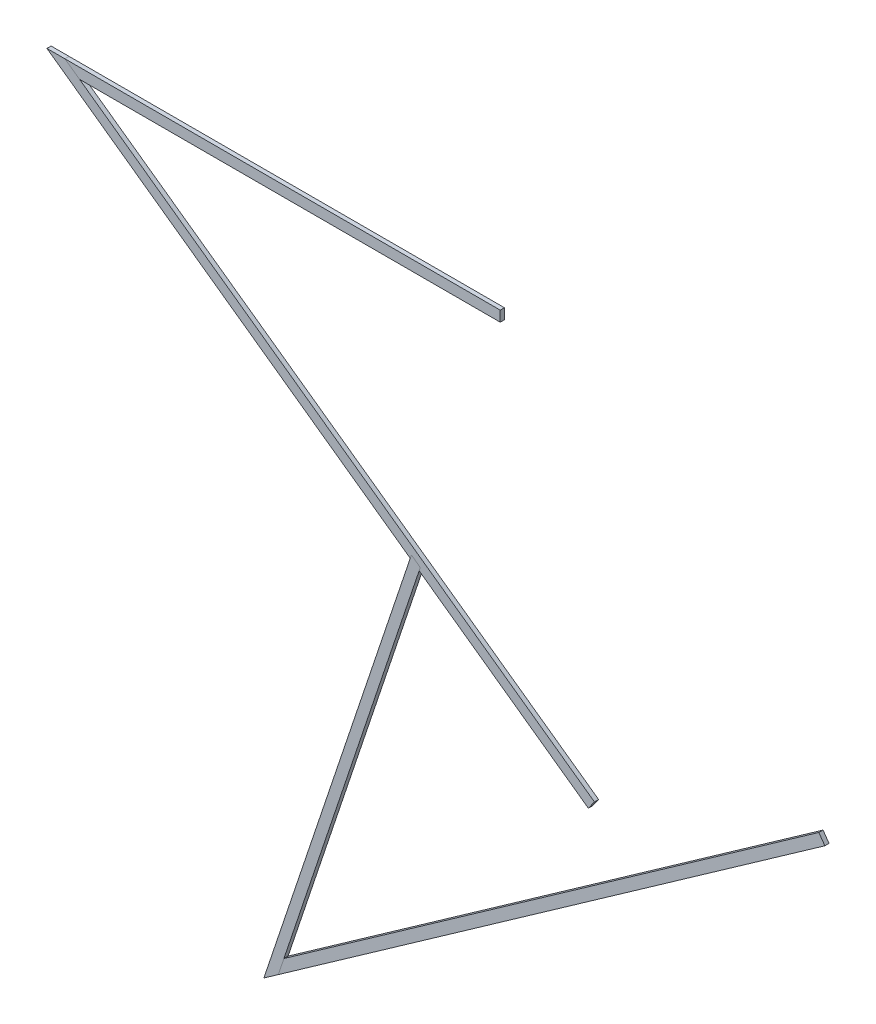
ISO-10303-21;
HEADER;
FILE_DESCRIPTION(('STEP AP214'),'2;1');
FILE_NAME('part.step','',(''),(''),'','','');
FILE_SCHEMA(('AUTOMOTIVE_DESIGN { 1 0 10303 214 1 1 1 1 }'));
ENDSEC;
DATA;
#1=APPLICATION_CONTEXT('core data for automotive mechanical design processes');
#2=APPLICATION_PROTOCOL_DEFINITION('international standard','automotive_design',2000,#1);
#3=PRODUCT_CONTEXT('',#1,'mechanical');
#4=PRODUCT('Part','Part','',(#3));
#5=PRODUCT_RELATED_PRODUCT_CATEGORY('part','',(#4));
#6=PRODUCT_DEFINITION_FORMATION('','',#4);
#7=PRODUCT_DEFINITION_CONTEXT('part definition',#1,'design');
#8=PRODUCT_DEFINITION('design','',#6,#7);
#9=PRODUCT_DEFINITION_SHAPE('','',#8);
#10=(LENGTH_UNIT() NAMED_UNIT(*) SI_UNIT(.MILLI.,.METRE.));
#11=(NAMED_UNIT(*) PLANE_ANGLE_UNIT() SI_UNIT($,.RADIAN.));
#12=(NAMED_UNIT(*) SI_UNIT($,.STERADIAN.) SOLID_ANGLE_UNIT());
#13=UNCERTAINTY_MEASURE_WITH_UNIT(LENGTH_MEASURE(1.E-05),#10,'distance_accuracy_value','');
#14=(GEOMETRIC_REPRESENTATION_CONTEXT(3) GLOBAL_UNCERTAINTY_ASSIGNED_CONTEXT((#13)) GLOBAL_UNIT_ASSIGNED_CONTEXT((#10,
#11,#12)) REPRESENTATION_CONTEXT('',''));
#15=CARTESIAN_POINT('',(0.,0.,0.));
#16=DIRECTION('',(0.,0.,1.));
#17=DIRECTION('',(1.,0.,0.));
#18=AXIS2_PLACEMENT_3D('',#15,#16,#17);
#19=CARTESIAN_POINT('',(-1036.87319744402,-730.003201056248,0.));
#20=DIRECTION('',(-0.817675868795569,-0.575678880617842,0.));
#21=DIRECTION('',(0.575678880617842,-0.817675868795569,0.));
#22=AXIS2_PLACEMENT_3D('',#19,#20,#21);
#23=PLANE('',#22);
#24=DIRECTION('',(-0.575678880617842,0.817675868795569,0.));
#25=VECTOR('',#24,1.);
#26=CARTESIAN_POINT('',(2074.62418961617,-5149.4745676088,2.00000000000001));
#27=LINE('',#26,#25);
#28=CARTESIAN_POINT('',(2080.38097842235,-5157.65132629675,2.));
#29=VERTEX_POINT('',#28);
#30=CARTESIAN_POINT('',(2074.62418961617,-5149.4745676088,2.00000000000001));
#31=VERTEX_POINT('',#30);
#32=EDGE_CURVE('E112',#29,#31,#27,.T.);
#33=ORIENTED_EDGE('',*,*,#32,.F.);
#34=DIRECTION('',(0.,0.,1.));
#35=VECTOR('',#34,1.);
#36=CARTESIAN_POINT('',(2080.38097842235,-5157.65132629675,-2.));
#37=LINE('',#36,#35);
#38=CARTESIAN_POINT('',(2080.38097842235,-5157.65132629675,-2.));
#39=VERTEX_POINT('',#38);
#40=EDGE_CURVE('E130',#39,#29,#37,.T.);
#41=ORIENTED_EDGE('',*,*,#40,.F.);
#42=DIRECTION('',(0.575678880617842,-0.817675868795569,0.));
#43=VECTOR('',#42,1.);
#44=CARTESIAN_POINT('',(2080.38097842235,-5157.65132629675,-2.));
#45=LINE('',#44,#43);
#46=CARTESIAN_POINT('',(2074.62418961617,-5149.4745676088,-1.99999999999999));
#47=VERTEX_POINT('',#46);
#48=EDGE_CURVE('E132',#47,#39,#45,.T.);
#49=ORIENTED_EDGE('',*,*,#48,.F.);
#50=DIRECTION('',(0.,0.,-1.));
#51=VECTOR('',#50,1.);
#52=CARTESIAN_POINT('',(2074.62418961617,-5149.4745676088,2.00000000000001));
#53=LINE('',#52,#51);
#54=EDGE_CURVE('E124',#31,#47,#53,.T.);
#55=ORIENTED_EDGE('',*,*,#54,.F.);
#56=EDGE_LOOP('',(#33,#41,#49,#55));
#57=FACE_BOUND('',#56,.T.);
#58=ADVANCED_FACE('F66',(#57),#23,.F.);
#59=CARTESIAN_POINT('',(1556.1754390635,-5526.71450845509,-2.));
#60=DIRECTION('',(-0.575678880617844,0.817675868795567,0.));
#61=DIRECTION('',(-0.817675868795567,-0.575678880617844,0.));
#62=AXIS2_PLACEMENT_3D('',#59,#60,#61);
#63=PLANE('',#62);
#64=DIRECTION('',(0.,0.,1.));
#65=VECTOR('',#64,1.);
#66=CARTESIAN_POINT('',(1557.5164646114,-5525.77036895464,-2.));
#67=LINE('',#66,#65);
#68=CARTESIAN_POINT('',(1557.5164646114,-5525.77036895464,-2.));
#69=VERTEX_POINT('',#68);
#70=CARTESIAN_POINT('',(1557.5164646114,-5525.77036895464,2.00000000000001));
#71=VERTEX_POINT('',#70);
#72=EDGE_CURVE('E13',#69,#71,#67,.T.);
#73=ORIENTED_EDGE('',*,*,#72,.F.);
#74=DIRECTION('',(0.817675868795567,0.575678880617844,0.));
#75=VECTOR('',#74,1.);
#76=CARTESIAN_POINT('',(1556.1754390635,-5526.71450845509,-2.));
#77=LINE('',#76,#75);
#78=EDGE_CURVE('E120',#69,#39,#77,.T.);
#79=ORIENTED_EDGE('',*,*,#78,.T.);
#80=ORIENTED_EDGE('',*,*,#40,.T.);
#81=DIRECTION('',(0.817675868795567,0.575678880617844,0.));
#82=VECTOR('',#81,1.);
#83=CARTESIAN_POINT('',(1556.1754390635,-5526.71450845509,2.));
#84=LINE('',#83,#82);
#85=EDGE_CURVE('E88',#71,#29,#84,.T.);
#86=ORIENTED_EDGE('',*,*,#85,.F.);
#87=EDGE_LOOP('',(#73,#79,#80,#86));
#88=FACE_BOUND('',#87,.T.);
#89=ADVANCED_FACE('F137',(#88),#63,.F.);
#90=CARTESIAN_POINT('',(1556.1754390635,-5526.71450845509,-2.));
#91=DIRECTION('',(0.,0.,1.));
#92=DIRECTION('',(0.,-1.,0.));
#93=AXIS2_PLACEMENT_3D('',#90,#91,#92);
#94=PLANE('',#93);
#95=DIRECTION('',(-0.317848997473055,-0.948141347482206,0.));
#96=VECTOR('',#95,1.);
#97=CARTESIAN_POINT('',(1694.22816504625,-5117.96031796375,-1.99999999999999));
#98=LINE('',#97,#96);
#99=CARTESIAN_POINT('',(1562.88287637629,-5509.76240000598,-1.99999999999999));
#100=VERTEX_POINT('',#99);
#101=EDGE_CURVE('E80',#100,#69,#98,.T.);
#102=ORIENTED_EDGE('',*,*,#101,.F.);
#103=DIRECTION('',(0.817675868795567,0.575678880617844,0.));
#104=VECTOR('',#103,1.);
#105=CARTESIAN_POINT('',(1550.41865025733,-5518.53774976713,-1.99999999999999));
#106=LINE('',#105,#104);
#107=EDGE_CURVE('E118',#100,#47,#106,.T.);
#108=ORIENTED_EDGE('',*,*,#107,.T.);
#109=ORIENTED_EDGE('',*,*,#48,.T.);
#110=ORIENTED_EDGE('',*,*,#78,.F.);
#111=EDGE_LOOP('',(#102,#108,#109,#110));
#112=FACE_BOUND('',#111,.T.);
#113=ADVANCED_FACE('F116',(#112),#94,.F.);
#114=CARTESIAN_POINT('',(1550.41865025733,-5518.53774976713,2.00000000000001));
#115=DIRECTION('',(0.575678880617844,-0.817675868795567,0.));
#116=DIRECTION('',(0.817675868795567,0.575678880617844,0.));
#117=AXIS2_PLACEMENT_3D('',#114,#115,#116);
#118=PLANE('',#117);
#119=DIRECTION('',(0.,0.,-1.));
#120=VECTOR('',#119,1.);
#121=CARTESIAN_POINT('',(1562.88287637629,-5509.76240000598,2.00000000000001));
#122=LINE('',#121,#120);
#123=CARTESIAN_POINT('',(1562.88287637629,-5509.76240000598,2.00000000000001));
#124=VERTEX_POINT('',#123);
#125=EDGE_CURVE('E106',#124,#100,#122,.T.);
#126=ORIENTED_EDGE('',*,*,#125,.F.);
#127=DIRECTION('',(0.817675868795567,0.575678880617844,0.));
#128=VECTOR('',#127,1.);
#129=CARTESIAN_POINT('',(1550.41865025733,-5518.53774976713,2.00000000000001));
#130=LINE('',#129,#128);
#131=EDGE_CURVE('E74',#124,#31,#130,.T.);
#132=ORIENTED_EDGE('',*,*,#131,.T.);
#133=ORIENTED_EDGE('',*,*,#54,.T.);
#134=ORIENTED_EDGE('',*,*,#107,.F.);
#135=EDGE_LOOP('',(#126,#132,#133,#134));
#136=FACE_BOUND('',#135,.T.);
#137=ADVANCED_FACE('F122',(#136),#118,.F.);
#138=CARTESIAN_POINT('',(1550.41865025733,-5518.53774976713,2.00000000000001));
#139=DIRECTION('',(0.,0.,-1.));
#140=DIRECTION('',(0.,1.,0.));
#141=AXIS2_PLACEMENT_3D('',#138,#139,#140);
#142=PLANE('',#141);
#143=DIRECTION('',(-0.317848997473055,-0.948141347482206,0.));
#144=VECTOR('',#143,1.);
#145=CARTESIAN_POINT('',(1694.22816504625,-5117.96031796375,2.00000000000001));
#146=LINE('',#145,#144);
#147=EDGE_CURVE('E108',#124,#71,#146,.T.);
#148=ORIENTED_EDGE('',*,*,#147,.T.);
#149=ORIENTED_EDGE('',*,*,#85,.T.);
#150=ORIENTED_EDGE('',*,*,#32,.T.);
#151=ORIENTED_EDGE('',*,*,#131,.F.);
#152=EDGE_LOOP('',(#148,#149,#150,#151));
#153=FACE_BOUND('',#152,.T.);
#154=ADVANCED_FACE('F68',(#153),#142,.F.);
#155=CARTESIAN_POINT('',(1694.22816504625,-5117.96031796375,2.00000000000001));
#156=DIRECTION('',(-0.948141347482206,0.317848997473055,0.));
#157=DIRECTION('',(-0.317848997473055,-0.948141347482206,0.));
#158=AXIS2_PLACEMENT_3D('',#155,#156,#157);
#159=PLANE('',#158);
#160=ORIENTED_EDGE('',*,*,#125,.T.);
#161=ORIENTED_EDGE('',*,*,#101,.T.);
#162=ORIENTED_EDGE('',*,*,#72,.T.);
#163=ORIENTED_EDGE('',*,*,#147,.F.);
#164=EDGE_LOOP('',(#160,#161,#162,#163));
#165=FACE_BOUND('',#164,.T.);
#166=ADVANCED_FACE('F107',(#165),#159,.T.);
#167=CLOSED_SHELL('',(#58,#89,#113,#137,#154,#166));
#168=MANIFOLD_SOLID_BREP('B2',#167);
#169=CARTESIAN_POINT('',(1694.22816504625,-5117.96031796375,2.00000000000001));
#170=DIRECTION('',(0.,0.,-1.));
#171=DIRECTION('',(-1.,0.,0.));
#172=AXIS2_PLACEMENT_3D('',#169,#170,#171);
#173=PLANE('',#172);
#174=DIRECTION('',(-0.817675868795568,-0.575678880617843,0.));
#175=VECTOR('',#174,1.);
#176=CARTESIAN_POINT('',(1840.88489233756,-5326.26684255595,2.00000000000015));
#177=LINE('',#176,#175);
#178=CARTESIAN_POINT('',(1557.5164646114,-5525.77036895465,2.00000000000001));
#179=VERTEX_POINT('',#178);
#180=CARTESIAN_POINT('',(1543.71121294453,-5535.48985821624,2.));
#181=VERTEX_POINT('',#180);
#182=EDGE_CURVE('E289',#179,#181,#177,.T.);
#183=ORIENTED_EDGE('',*,*,#182,.F.);
#184=DIRECTION('',(-0.317848997473055,-0.948141347482206,0.));
#185=VECTOR('',#184,1.);
#186=CARTESIAN_POINT('',(1694.22816504625,-5117.96031796375,2.00000000000001));
#187=LINE('',#186,#185);
#188=CARTESIAN_POINT('',(1694.22816504625,-5117.96031796375,2.00000000000001));
#189=VERTEX_POINT('',#188);
#190=EDGE_CURVE('E290',#189,#179,#187,.T.);
#191=ORIENTED_EDGE('',*,*,#190,.F.);
#192=DIRECTION('',(0.948141347482205,-0.317848997473057,0.));
#193=VECTOR('',#192,1.);
#194=CARTESIAN_POINT('',(1694.22816504625,-5117.96031796375,2.00000000000001));
#195=LINE('',#194,#193);
#196=CARTESIAN_POINT('',(1684.74675157143,-5114.78182798902,2.));
#197=VERTEX_POINT('',#196);
#198=EDGE_CURVE('E305',#197,#189,#195,.T.);
#199=ORIENTED_EDGE('',*,*,#198,.F.);
#200=DIRECTION('',(-0.317848997473055,-0.948141347482206,0.));
#201=VECTOR('',#200,1.);
#202=CARTESIAN_POINT('',(1684.74675157143,-5114.78182798902,2.));
#203=LINE('',#202,#201);
#204=EDGE_CURVE('E244',#197,#181,#203,.T.);
#205=ORIENTED_EDGE('',*,*,#204,.T.);
#206=EDGE_LOOP('',(#183,#191,#199,#205));
#207=FACE_BOUND('',#206,.T.);
#208=ADVANCED_FACE('F240',(#207),#173,.F.);
#209=CARTESIAN_POINT('',(1694.22816504625,-5117.96031796375,2.00000000000001));
#210=DIRECTION('',(-0.948141347482206,0.317848997473055,0.));
#211=DIRECTION('',(-0.317848997473055,-0.948141347482206,0.));
#212=AXIS2_PLACEMENT_3D('',#209,#210,#211);
#213=PLANE('',#212);
#214=DIRECTION('',(0.,0.,1.));
#215=VECTOR('',#214,1.);
#216=CARTESIAN_POINT('',(1557.5164646114,-5525.77036895465,2.00000000000001));
#217=LINE('',#216,#215);
#218=CARTESIAN_POINT('',(1557.5164646114,-5525.77036895465,-1.99999999999999));
#219=VERTEX_POINT('',#218);
#220=EDGE_CURVE('E278',#219,#179,#217,.T.);
#221=ORIENTED_EDGE('',*,*,#220,.F.);
#222=DIRECTION('',(-0.317848997473055,-0.948141347482206,0.));
#223=VECTOR('',#222,1.);
#224=CARTESIAN_POINT('',(1694.22816504625,-5117.96031796375,-1.99999999999999));
#225=LINE('',#224,#223);
#226=CARTESIAN_POINT('',(1694.22816504625,-5117.96031796375,-1.99999999999999));
#227=VERTEX_POINT('',#226);
#228=EDGE_CURVE('E295',#227,#219,#225,.T.);
#229=ORIENTED_EDGE('',*,*,#228,.F.);
#230=DIRECTION('',(0.,0.,-1.));
#231=VECTOR('',#230,1.);
#232=CARTESIAN_POINT('',(1694.22816504625,-5117.96031796375,2.00000000000001));
#233=LINE('',#232,#231);
#234=EDGE_CURVE('E273',#189,#227,#233,.T.);
#235=ORIENTED_EDGE('',*,*,#234,.F.);
#236=ORIENTED_EDGE('',*,*,#190,.T.);
#237=EDGE_LOOP('',(#221,#229,#235,#236));
#238=FACE_BOUND('',#237,.T.);
#239=ADVANCED_FACE('F294',(#238),#213,.F.);
#240=CARTESIAN_POINT('',(1684.74675157143,-5114.78182798902,-2.));
#241=DIRECTION('',(0.,0.,1.));
#242=DIRECTION('',(1.,0.,0.));
#243=AXIS2_PLACEMENT_3D('',#240,#241,#242);
#244=PLANE('',#243);
#245=DIRECTION('',(0.817675868795568,0.575678880617843,0.));
#246=VECTOR('',#245,1.);
#247=CARTESIAN_POINT('',(1836.04185258323,-5329.67655025426,-1.99999999999985));
#248=LINE('',#247,#246);
#249=CARTESIAN_POINT('',(1543.71121294453,-5535.48985821624,-2.));
#250=VERTEX_POINT('',#249);
#251=EDGE_CURVE('E64',#250,#219,#248,.T.);
#252=ORIENTED_EDGE('',*,*,#251,.F.);
#253=DIRECTION('',(-0.317848997473055,-0.948141347482206,0.));
#254=VECTOR('',#253,1.);
#255=CARTESIAN_POINT('',(1684.74675157143,-5114.78182798902,-2.));
#256=LINE('',#255,#254);
#257=CARTESIAN_POINT('',(1684.74675157143,-5114.78182798902,-2.));
#258=VERTEX_POINT('',#257);
#259=EDGE_CURVE('E304',#258,#250,#256,.T.);
#260=ORIENTED_EDGE('',*,*,#259,.F.);
#261=DIRECTION('',(-0.948141347482205,0.317848997473057,0.));
#262=VECTOR('',#261,1.);
#263=CARTESIAN_POINT('',(1684.74675157143,-5114.78182798902,-2.));
#264=LINE('',#263,#262);
#265=EDGE_CURVE('E299',#227,#258,#264,.T.);
#266=ORIENTED_EDGE('',*,*,#265,.F.);
#267=ORIENTED_EDGE('',*,*,#228,.T.);
#268=EDGE_LOOP('',(#252,#260,#266,#267));
#269=FACE_BOUND('',#268,.T.);
#270=ADVANCED_FACE('F313',(#269),#244,.F.);
#271=CARTESIAN_POINT('',(1684.74675157143,-5114.78182798902,-2.));
#272=DIRECTION('',(0.948141347482206,-0.317848997473055,0.));
#273=DIRECTION('',(0.317848997473055,0.948141347482206,0.));
#274=AXIS2_PLACEMENT_3D('',#271,#272,#273);
#275=PLANE('',#274);
#276=DIRECTION('',(0.,0.,-1.));
#277=VECTOR('',#276,1.);
#278=CARTESIAN_POINT('',(1543.71121294453,-5535.48985821624,-2.));
#279=LINE('',#278,#277);
#280=EDGE_CURVE('E250',#181,#250,#279,.T.);
#281=ORIENTED_EDGE('',*,*,#280,.F.);
#282=ORIENTED_EDGE('',*,*,#204,.F.);
#283=DIRECTION('',(0.,0.,1.));
#284=VECTOR('',#283,1.);
#285=CARTESIAN_POINT('',(1684.74675157143,-5114.78182798902,-2.));
#286=LINE('',#285,#284);
#287=EDGE_CURVE('E259',#258,#197,#286,.T.);
#288=ORIENTED_EDGE('',*,*,#287,.F.);
#289=ORIENTED_EDGE('',*,*,#259,.T.);
#290=EDGE_LOOP('',(#281,#282,#288,#289));
#291=FACE_BOUND('',#290,.T.);
#292=ADVANCED_FACE('F314',(#291),#275,.F.);
#293=CARTESIAN_POINT('',(6818.85480079915,-6835.90821984908,0.));
#294=DIRECTION('',(0.317848997473057,0.948141347482206,0.));
#295=DIRECTION('',(-0.948141347482206,0.317848997473057,0.));
#296=AXIS2_PLACEMENT_3D('',#293,#294,#295);
#297=PLANE('',#296);
#298=ORIENTED_EDGE('',*,*,#198,.T.);
#299=ORIENTED_EDGE('',*,*,#234,.T.);
#300=ORIENTED_EDGE('',*,*,#265,.T.);
#301=ORIENTED_EDGE('',*,*,#287,.T.);
#302=EDGE_LOOP('',(#298,#299,#300,#301));
#303=FACE_BOUND('',#302,.T.);
#304=ADVANCED_FACE('F311',(#303),#297,.T.);
#305=CARTESIAN_POINT('',(1556.17543906351,-5526.71450845509,2.00000000000001));
#306=DIRECTION('',(0.575678880617843,-0.817675868795569,0.));
#307=DIRECTION('',(0.817675868795568,0.575678880617843,0.));
#308=AXIS2_PLACEMENT_3D('',#305,#306,#307);
#309=PLANE('',#308);
#310=ORIENTED_EDGE('',*,*,#220,.T.);
#311=ORIENTED_EDGE('',*,*,#182,.T.);
#312=ORIENTED_EDGE('',*,*,#280,.T.);
#313=ORIENTED_EDGE('',*,*,#251,.T.);
#314=EDGE_LOOP('',(#310,#311,#312,#313));
#315=FACE_BOUND('',#314,.T.);
#316=ADVANCED_FACE('F242',(#315),#309,.T.);
#317=CLOSED_SHELL('',(#208,#239,#270,#292,#304,#316));
#318=MANIFOLD_SOLID_BREP('B7',#317);
#319=CARTESIAN_POINT('',(1351.7834315983,-4869.1425505764,2.00000000000001));
#320=DIRECTION('',(0.,0.,-1.));
#321=DIRECTION('',(0.,1.,0.));
#322=AXIS2_PLACEMENT_3D('',#319,#320,#321);
#323=PLANE('',#322);
#324=DIRECTION('',(-0.813325166488411,0.581809396242961,0.));
#325=VECTOR('',#324,1.);
#326=CARTESIAN_POINT('',(1859.94982531455,-5231.51005215505,2.));
#327=LINE('',#326,#325);
#328=CARTESIAN_POINT('',(1367.36693006188,-4879.1425505764,2.));
#329=VERTEX_POINT('',#328);
#330=CARTESIAN_POINT('',(1353.38769267347,-4869.1425505764,2.));
#331=VERTEX_POINT('',#330);
#332=EDGE_CURVE('E238',#329,#331,#327,.T.);
#333=ORIENTED_EDGE('',*,*,#332,.F.);
#334=DIRECTION('',(1.,0.,0.));
#335=VECTOR('',#334,1.);
#336=CARTESIAN_POINT('',(1351.7834315983,-4879.1425505764,2.));
#337=LINE('',#336,#335);
#338=CARTESIAN_POINT('',(1769.83761149153,-4879.1425505764,2.));
#339=VERTEX_POINT('',#338);
#340=EDGE_CURVE('E416',#329,#339,#337,.T.);
#341=ORIENTED_EDGE('',*,*,#340,.T.);
#342=DIRECTION('',(0.,1.,0.));
#343=VECTOR('',#342,1.);
#344=CARTESIAN_POINT('',(1769.83761149153,-4869.1425505764,2.00000000000001));
#345=LINE('',#344,#343);
#346=CARTESIAN_POINT('',(1769.83761149153,-4869.1425505764,2.00000000000001));
#347=VERTEX_POINT('',#346);
#348=EDGE_CURVE('E482',#339,#347,#345,.T.);
#349=ORIENTED_EDGE('',*,*,#348,.T.);
#350=DIRECTION('',(1.,0.,0.));
#351=VECTOR('',#350,1.);
#352=CARTESIAN_POINT('',(1351.7834315983,-4869.1425505764,2.00000000000001));
#353=LINE('',#352,#351);
#354=EDGE_CURVE('E472',#331,#347,#353,.T.);
#355=ORIENTED_EDGE('',*,*,#354,.F.);
#356=EDGE_LOOP('',(#333,#341,#349,#355));
#357=FACE_BOUND('',#356,.T.);
#358=ADVANCED_FACE('F413',(#357),#323,.F.);
#359=CARTESIAN_POINT('',(1351.7834315983,-4869.1425505764,2.00000000000001));
#360=DIRECTION('',(0.,-1.,0.));
#361=DIRECTION('',(0.,0.,-1.));
#362=AXIS2_PLACEMENT_3D('',#359,#360,#361);
#363=PLANE('',#362);
#364=DIRECTION('',(0.,0.,-1.));
#365=VECTOR('',#364,1.);
#366=CARTESIAN_POINT('',(1353.38769267347,-4869.1425505764,2.00000000000001));
#367=LINE('',#366,#365);
#368=CARTESIAN_POINT('',(1353.38769267347,-4869.1425505764,-2.));
#369=VERTEX_POINT('',#368);
#370=EDGE_CURVE('E449',#331,#369,#367,.T.);
#371=ORIENTED_EDGE('',*,*,#370,.F.);
#372=ORIENTED_EDGE('',*,*,#354,.T.);
#373=DIRECTION('',(0.,0.,-1.));
#374=VECTOR('',#373,1.);
#375=CARTESIAN_POINT('',(1769.83761149153,-4869.1425505764,2.00000000000001));
#376=LINE('',#375,#374);
#377=CARTESIAN_POINT('',(1769.83761149153,-4869.1425505764,-1.99999999999999));
#378=VERTEX_POINT('',#377);
#379=EDGE_CURVE('E463',#347,#378,#376,.T.);
#380=ORIENTED_EDGE('',*,*,#379,.T.);
#381=DIRECTION('',(1.,0.,0.));
#382=VECTOR('',#381,1.);
#383=CARTESIAN_POINT('',(1351.7834315983,-4869.1425505764,-1.99999999999999));
#384=LINE('',#383,#382);
#385=EDGE_CURVE('E460',#369,#378,#384,.T.);
#386=ORIENTED_EDGE('',*,*,#385,.F.);
#387=EDGE_LOOP('',(#371,#372,#380,#386));
#388=FACE_BOUND('',#387,.T.);
#389=ADVANCED_FACE('F465',(#388),#363,.F.);
#390=CARTESIAN_POINT('',(1351.7834315983,-4879.1425505764,-2.));
#391=DIRECTION('',(0.,0.,1.));
#392=DIRECTION('',(0.,-1.,0.));
#393=AXIS2_PLACEMENT_3D('',#390,#391,#392);
#394=PLANE('',#393);
#395=DIRECTION('',(-0.813325166488411,0.581809396242961,0.));
#396=VECTOR('',#395,1.);
#397=CARTESIAN_POINT('',(1859.94982531455,-5231.51005215505,-2.));
#398=LINE('',#397,#396);
#399=CARTESIAN_POINT('',(1367.36693006188,-4879.1425505764,-2.));
#400=VERTEX_POINT('',#399);
#401=EDGE_CURVE('E447',#400,#369,#398,.T.);
#402=ORIENTED_EDGE('',*,*,#401,.T.);
#403=ORIENTED_EDGE('',*,*,#385,.T.);
#404=DIRECTION('',(0.,-1.,0.));
#405=VECTOR('',#404,1.);
#406=CARTESIAN_POINT('',(1769.83761149153,-4879.1425505764,-2.));
#407=LINE('',#406,#405);
#408=CARTESIAN_POINT('',(1769.83761149153,-4879.1425505764,-2.));
#409=VERTEX_POINT('',#408);
#410=EDGE_CURVE('E468',#378,#409,#407,.T.);
#411=ORIENTED_EDGE('',*,*,#410,.T.);
#412=DIRECTION('',(1.,0.,0.));
#413=VECTOR('',#412,1.);
#414=CARTESIAN_POINT('',(1351.7834315983,-4879.1425505764,-2.));
#415=LINE('',#414,#413);
#416=EDGE_CURVE('E462',#400,#409,#415,.T.);
#417=ORIENTED_EDGE('',*,*,#416,.F.);
#418=EDGE_LOOP('',(#402,#403,#411,#417));
#419=FACE_BOUND('',#418,.T.);
#420=ADVANCED_FACE('F458',(#419),#394,.F.);
#421=CARTESIAN_POINT('',(1351.7834315983,-4879.1425505764,-2.));
#422=DIRECTION('',(0.,1.,0.));
#423=DIRECTION('',(0.,0.,1.));
#424=AXIS2_PLACEMENT_3D('',#421,#422,#423);
#425=PLANE('',#424);
#426=DIRECTION('',(0.,0.,1.));
#427=VECTOR('',#426,1.);
#428=CARTESIAN_POINT('',(1367.36693006188,-4879.1425505764,-2.));
#429=LINE('',#428,#427);
#430=EDGE_CURVE('E422',#400,#329,#429,.T.);
#431=ORIENTED_EDGE('',*,*,#430,.F.);
#432=ORIENTED_EDGE('',*,*,#416,.T.);
#433=DIRECTION('',(0.,0.,1.));
#434=VECTOR('',#433,1.);
#435=CARTESIAN_POINT('',(1769.83761149153,-4879.1425505764,-2.));
#436=LINE('',#435,#434);
#437=EDGE_CURVE('E454',#409,#339,#436,.T.);
#438=ORIENTED_EDGE('',*,*,#437,.T.);
#439=ORIENTED_EDGE('',*,*,#340,.F.);
#440=EDGE_LOOP('',(#431,#432,#438,#439));
#441=FACE_BOUND('',#440,.T.);
#442=ADVANCED_FACE('F485',(#441),#425,.F.);
#443=CARTESIAN_POINT('',(1769.83761149154,535.775871514749,0.));
#444=DIRECTION('',(-1.,0.,0.));
#445=DIRECTION('',(0.,-1.,0.));
#446=AXIS2_PLACEMENT_3D('',#443,#444,#445);
#447=PLANE('',#446);
#448=ORIENTED_EDGE('',*,*,#348,.F.);
#449=ORIENTED_EDGE('',*,*,#437,.F.);
#450=ORIENTED_EDGE('',*,*,#410,.F.);
#451=ORIENTED_EDGE('',*,*,#379,.F.);
#452=EDGE_LOOP('',(#448,#449,#450,#451));
#453=FACE_BOUND('',#452,.T.);
#454=ADVANCED_FACE('F487',(#453),#447,.F.);
#455=CARTESIAN_POINT('',(1859.94982531455,-5231.51005215505,-2.));
#456=DIRECTION('',(-0.581809396242961,-0.813325166488411,0.));
#457=DIRECTION('',(0.813325166488411,-0.581809396242961,0.));
#458=AXIS2_PLACEMENT_3D('',#455,#456,#457);
#459=PLANE('',#458);
#460=ORIENTED_EDGE('',*,*,#370,.T.);
#461=ORIENTED_EDGE('',*,*,#401,.F.);
#462=ORIENTED_EDGE('',*,*,#430,.T.);
#463=ORIENTED_EDGE('',*,*,#332,.T.);
#464=EDGE_LOOP('',(#460,#461,#462,#463));
#465=FACE_BOUND('',#464,.T.);
#466=ADVANCED_FACE('F450',(#465),#459,.T.);
#467=CLOSED_SHELL('',(#358,#389,#420,#442,#454,#466));
#468=MANIFOLD_SOLID_BREP('B58',#467);
#469=CARTESIAN_POINT('',(1854.13173135212,-5239.64330381994,2.00000000000001));
#470=DIRECTION('',(0.,0.,-1.));
#471=DIRECTION('',(0.,1.,0.));
#472=AXIS2_PLACEMENT_3D('',#469,#470,#471);
#473=PLANE('',#472);
#474=DIRECTION('',(1.,0.,0.));
#475=VECTOR('',#474,1.);
#476=CARTESIAN_POINT('',(1854.13173135212,-4869.1425505764,1.9999999999998));
#477=LINE('',#476,#475);
#478=CARTESIAN_POINT('',(1336.19993313474,-4869.1425505764,2.00000000000001));
#479=VERTEX_POINT('',#478);
#480=CARTESIAN_POINT('',(1353.38769267347,-4869.1425505764,2.));
#481=VERTEX_POINT('',#480);
#482=EDGE_CURVE('E626',#479,#481,#477,.T.);
#483=ORIENTED_EDGE('',*,*,#482,.F.);
#484=DIRECTION('',(-0.813325166488411,0.581809396242961,0.));
#485=VECTOR('',#484,1.);
#486=CARTESIAN_POINT('',(1854.13173135212,-5239.64330381994,2.00000000000001));
#487=LINE('',#486,#485);
#488=CARTESIAN_POINT('',(1854.13173135212,-5239.64330381994,2.00000000000001));
#489=VERTEX_POINT('',#488);
#490=EDGE_CURVE('E627',#489,#479,#487,.T.);
#491=ORIENTED_EDGE('',*,*,#490,.F.);
#492=DIRECTION('',(-0.581809396242963,-0.813325166488409,0.));
#493=VECTOR('',#492,1.);
#494=CARTESIAN_POINT('',(1854.13173135212,-5239.64330381994,2.00000000000001));
#495=LINE('',#494,#493);
#496=CARTESIAN_POINT('',(1859.94982531455,-5231.51005215505,2.));
#497=VERTEX_POINT('',#496);
#498=EDGE_CURVE('E642',#497,#489,#495,.T.);
#499=ORIENTED_EDGE('',*,*,#498,.F.);
#500=DIRECTION('',(-0.813325166488411,0.581809396242961,0.));
#501=VECTOR('',#500,1.);
#502=CARTESIAN_POINT('',(1859.94982531455,-5231.51005215505,2.));
#503=LINE('',#502,#501);
#504=EDGE_CURVE('E581',#497,#481,#503,.T.);
#505=ORIENTED_EDGE('',*,*,#504,.T.);
#506=EDGE_LOOP('',(#483,#491,#499,#505));
#507=FACE_BOUND('',#506,.T.);
#508=ADVANCED_FACE('F577',(#507),#473,.F.);
#509=CARTESIAN_POINT('',(1854.13173135212,-5239.64330381994,2.00000000000001));
#510=DIRECTION('',(0.581809396242961,0.813325166488411,0.));
#511=DIRECTION('',(-0.813325166488411,0.581809396242961,0.));
#512=AXIS2_PLACEMENT_3D('',#509,#510,#511);
#513=PLANE('',#512);
#514=DIRECTION('',(0.,0.,1.));
#515=VECTOR('',#514,1.);
#516=CARTESIAN_POINT('',(1336.19993313474,-4869.1425505764,2.00000000000001));
#517=LINE('',#516,#515);
#518=CARTESIAN_POINT('',(1336.19993313474,-4869.1425505764,-1.99999999999999));
#519=VERTEX_POINT('',#518);
#520=EDGE_CURVE('E615',#519,#479,#517,.T.);
#521=ORIENTED_EDGE('',*,*,#520,.F.);
#522=DIRECTION('',(-0.813325166488411,0.581809396242961,0.));
#523=VECTOR('',#522,1.);
#524=CARTESIAN_POINT('',(1854.13173135212,-5239.64330381994,-1.99999999999999));
#525=LINE('',#524,#523);
#526=CARTESIAN_POINT('',(1854.13173135212,-5239.64330381994,-1.99999999999999));
#527=VERTEX_POINT('',#526);
#528=EDGE_CURVE('E632',#527,#519,#525,.T.);
#529=ORIENTED_EDGE('',*,*,#528,.F.);
#530=DIRECTION('',(0.,0.,-1.));
#531=VECTOR('',#530,1.);
#532=CARTESIAN_POINT('',(1854.13173135212,-5239.64330381994,2.00000000000001));
#533=LINE('',#532,#531);
#534=EDGE_CURVE('E610',#489,#527,#533,.T.);
#535=ORIENTED_EDGE('',*,*,#534,.F.);
#536=ORIENTED_EDGE('',*,*,#490,.T.);
#537=EDGE_LOOP('',(#521,#529,#535,#536));
#538=FACE_BOUND('',#537,.T.);
#539=ADVANCED_FACE('F631',(#538),#513,.F.);
#540=CARTESIAN_POINT('',(1859.94982531455,-5231.51005215505,-2.));
#541=DIRECTION('',(0.,0.,1.));
#542=DIRECTION('',(0.,-1.,0.));
#543=AXIS2_PLACEMENT_3D('',#540,#541,#542);
#544=PLANE('',#543);
#545=DIRECTION('',(-1.,0.,0.));
#546=VECTOR('',#545,1.);
#547=CARTESIAN_POINT('',(1859.94982531455,-4869.1425505764,-2.0000000000002));
#548=LINE('',#547,#546);
#549=CARTESIAN_POINT('',(1353.38769267347,-4869.1425505764,-2.));
#550=VERTEX_POINT('',#549);
#551=EDGE_CURVE('E411',#550,#519,#548,.T.);
#552=ORIENTED_EDGE('',*,*,#551,.F.);
#553=DIRECTION('',(-0.813325166488411,0.581809396242961,0.));
#554=VECTOR('',#553,1.);
#555=CARTESIAN_POINT('',(1859.94982531455,-5231.51005215505,-2.));
#556=LINE('',#555,#554);
#557=CARTESIAN_POINT('',(1859.94982531455,-5231.51005215505,-2.));
#558=VERTEX_POINT('',#557);
#559=EDGE_CURVE('E641',#558,#550,#556,.T.);
#560=ORIENTED_EDGE('',*,*,#559,.F.);
#561=DIRECTION('',(0.581809396242963,0.813325166488409,0.));
#562=VECTOR('',#561,1.);
#563=CARTESIAN_POINT('',(1859.94982531455,-5231.51005215505,-2.));
#564=LINE('',#563,#562);
#565=EDGE_CURVE('E636',#527,#558,#564,.T.);
#566=ORIENTED_EDGE('',*,*,#565,.F.);
#567=ORIENTED_EDGE('',*,*,#528,.T.);
#568=EDGE_LOOP('',(#552,#560,#566,#567));
#569=FACE_BOUND('',#568,.T.);
#570=ADVANCED_FACE('F650',(#569),#544,.F.);
#571=CARTESIAN_POINT('',(1859.94982531455,-5231.51005215505,-2.));
#572=DIRECTION('',(-0.581809396242961,-0.813325166488411,0.));
#573=DIRECTION('',(0.813325166488411,-0.581809396242961,0.));
#574=AXIS2_PLACEMENT_3D('',#571,#572,#573);
#575=PLANE('',#574);
#576=DIRECTION('',(0.,0.,-1.));
#577=VECTOR('',#576,1.);
#578=CARTESIAN_POINT('',(1353.38769267347,-4869.1425505764,-2.));
#579=LINE('',#578,#577);
#580=EDGE_CURVE('E587',#481,#550,#579,.T.);
#581=ORIENTED_EDGE('',*,*,#580,.F.);
#582=ORIENTED_EDGE('',*,*,#504,.F.);
#583=DIRECTION('',(0.,0.,1.));
#584=VECTOR('',#583,1.);
#585=CARTESIAN_POINT('',(1859.94982531455,-5231.51005215505,-2.));
#586=LINE('',#585,#584);
#587=EDGE_CURVE('E596',#558,#497,#586,.T.);
#588=ORIENTED_EDGE('',*,*,#587,.F.);
#589=ORIENTED_EDGE('',*,*,#559,.T.);
#590=EDGE_LOOP('',(#581,#582,#588,#589));
#591=FACE_BOUND('',#590,.T.);
#592=ADVANCED_FACE('F651',(#591),#575,.F.);
#593=CARTESIAN_POINT('',(-1290.5005925472,-9635.59947932349,0.));
#594=DIRECTION('',(0.813325166488409,-0.581809396242964,0.));
#595=DIRECTION('',(0.581809396242964,0.813325166488409,0.));
#596=AXIS2_PLACEMENT_3D('',#593,#594,#595);
#597=PLANE('',#596);
#598=ORIENTED_EDGE('',*,*,#498,.T.);
#599=ORIENTED_EDGE('',*,*,#534,.T.);
#600=ORIENTED_EDGE('',*,*,#565,.T.);
#601=ORIENTED_EDGE('',*,*,#587,.T.);
#602=EDGE_LOOP('',(#598,#599,#600,#601));
#603=FACE_BOUND('',#602,.T.);
#604=ADVANCED_FACE('F648',(#603),#597,.T.);
#605=CARTESIAN_POINT('',(1351.7834315983,-4869.1425505764,-2.));
#606=DIRECTION('',(0.,1.,0.));
#607=DIRECTION('',(-1.,0.,0.));
#608=AXIS2_PLACEMENT_3D('',#605,#606,#607);
#609=PLANE('',#608);
#610=ORIENTED_EDGE('',*,*,#520,.T.);
#611=ORIENTED_EDGE('',*,*,#482,.T.);
#612=ORIENTED_EDGE('',*,*,#580,.T.);
#613=ORIENTED_EDGE('',*,*,#551,.T.);
#614=EDGE_LOOP('',(#610,#611,#612,#613));
#615=FACE_BOUND('',#614,.T.);
#616=ADVANCED_FACE('F579',(#615),#609,.T.);
#617=CLOSED_SHELL('',(#508,#539,#570,#592,#604,#616));
#618=MANIFOLD_SOLID_BREP('B232',#617);
#619=ADVANCED_BREP_SHAPE_REPRESENTATION('',(#18,#168,#318,#468,#618),#14);
#620=SHAPE_DEFINITION_REPRESENTATION(#9,#619);
ENDSEC;
END-ISO-10303-21;
